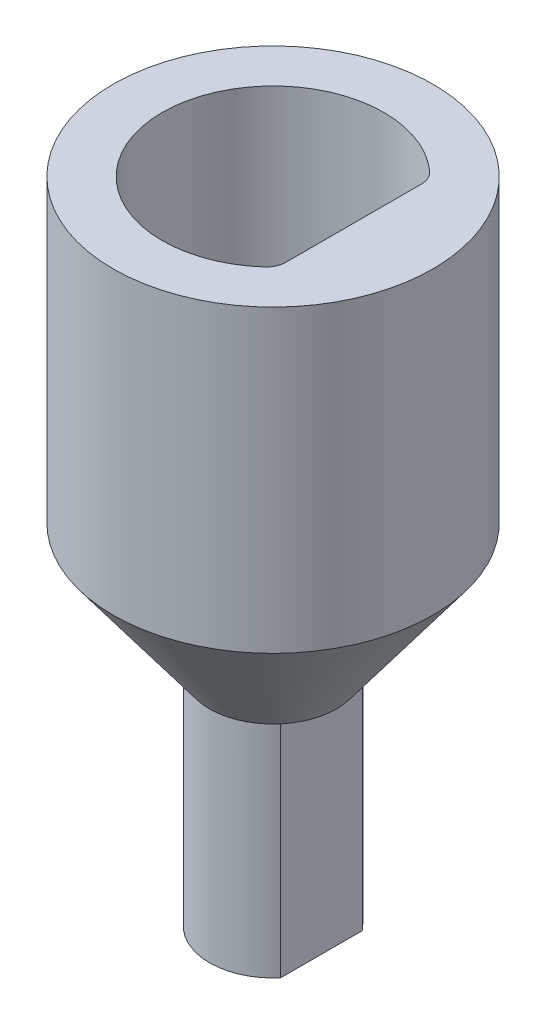
ISO-10303-21;
HEADER;
FILE_DESCRIPTION(('STEP AP214'),'2;1');
FILE_NAME('part.step','',(''),(''),'','','');
FILE_SCHEMA(('AUTOMOTIVE_DESIGN { 1 0 10303 214 1 1 1 1 }'));
ENDSEC;
DATA;
#1=APPLICATION_CONTEXT('core data for automotive mechanical design processes');
#2=APPLICATION_PROTOCOL_DEFINITION('international standard','automotive_design',2000,#1);
#3=PRODUCT_CONTEXT('',#1,'mechanical');
#4=PRODUCT('Part','Part','',(#3));
#5=PRODUCT_RELATED_PRODUCT_CATEGORY('part','',(#4));
#6=PRODUCT_DEFINITION_FORMATION('','',#4);
#7=PRODUCT_DEFINITION_CONTEXT('part definition',#1,'design');
#8=PRODUCT_DEFINITION('design','',#6,#7);
#9=PRODUCT_DEFINITION_SHAPE('','',#8);
#10=(LENGTH_UNIT() NAMED_UNIT(*) SI_UNIT(.MILLI.,.METRE.));
#11=(NAMED_UNIT(*) PLANE_ANGLE_UNIT() SI_UNIT($,.RADIAN.));
#12=(NAMED_UNIT(*) SI_UNIT($,.STERADIAN.) SOLID_ANGLE_UNIT());
#13=UNCERTAINTY_MEASURE_WITH_UNIT(LENGTH_MEASURE(1.E-05),#10,'distance_accuracy_value','');
#14=(GEOMETRIC_REPRESENTATION_CONTEXT(3) GLOBAL_UNCERTAINTY_ASSIGNED_CONTEXT((#13)) GLOBAL_UNIT_ASSIGNED_CONTEXT((#10,
#11,#12)) REPRESENTATION_CONTEXT('',''));
#15=CARTESIAN_POINT('',(0.,0.,0.));
#16=DIRECTION('',(0.,0.,1.));
#17=DIRECTION('',(1.,0.,0.));
#18=AXIS2_PLACEMENT_3D('',#15,#16,#17);
#19=CARTESIAN_POINT('',(0.,-22.4736663820587,0.));
#20=DIRECTION('',(0.,1.,0.));
#21=DIRECTION('',(0.,0.,1.));
#22=AXIS2_PLACEMENT_3D('',#19,#20,#21);
#23=CYLINDRICAL_SURFACE('',#22,3.175);
#24=DIRECTION('',(0.,1.,0.));
#25=VECTOR('',#24,1.);
#26=CARTESIAN_POINT('',(2.425,-22.4736663820587,-2.04939015319192));
#27=LINE('',#26,#25);
#28=CARTESIAN_POINT('',(2.425,-22.4736663820587,-2.04939015319192));
#29=VERTEX_POINT('',#28);
#30=CARTESIAN_POINT('',(2.425,-11.4736663820587,-2.04939015319192));
#31=VERTEX_POINT('',#30);
#32=EDGE_CURVE('E102',#29,#31,#27,.T.);
#33=ORIENTED_EDGE('',*,*,#32,.F.);
#34=CARTESIAN_POINT('',(0.,-22.4736663820587,0.));
#35=DIRECTION('',(0.,1.,0.));
#36=DIRECTION('',(0.,0.,1.));
#37=AXIS2_PLACEMENT_3D('',#34,#35,#36);
#38=CIRCLE('',#37,3.175);
#39=CARTESIAN_POINT('',(2.425,-22.4736663820587,2.04939015319192));
#40=VERTEX_POINT('',#39);
#41=EDGE_CURVE('E107',#29,#40,#38,.T.);
#42=ORIENTED_EDGE('',*,*,#41,.T.);
#43=DIRECTION('',(0.,1.,0.));
#44=VECTOR('',#43,1.);
#45=CARTESIAN_POINT('',(2.425,-22.4736663820587,2.04939015319192));
#46=LINE('',#45,#44);
#47=CARTESIAN_POINT('',(2.425,-11.4736663820587,2.04939015319192));
#48=VERTEX_POINT('',#47);
#49=EDGE_CURVE('E99',#48,#40,#46,.F.);
#50=ORIENTED_EDGE('',*,*,#49,.F.);
#51=CARTESIAN_POINT('',(0.,-11.4736663820587,0.));
#52=DIRECTION('',(0.,1.,0.));
#53=DIRECTION('',(0.,0.,1.));
#54=AXIS2_PLACEMENT_3D('',#51,#52,#53);
#55=CIRCLE('',#54,3.175);
#56=EDGE_CURVE('E94',#31,#48,#55,.T.);
#57=ORIENTED_EDGE('',*,*,#56,.F.);
#58=EDGE_LOOP('',(#33,#42,#50,#57));
#59=FACE_BOUND('',#58,.T.);
#60=ADVANCED_FACE('F35',(#59),#23,.T.);
#61=CARTESIAN_POINT('',(3.175,-22.4736663820587,0.));
#62=DIRECTION('',(0.,1.,0.));
#63=DIRECTION('',(0.,0.,1.));
#64=AXIS2_PLACEMENT_3D('',#61,#62,#63);
#65=PLANE('',#64);
#66=DIRECTION('',(0.,0.,-1.));
#67=VECTOR('',#66,1.);
#68=CARTESIAN_POINT('',(2.425,-22.4736663820587,0.));
#69=LINE('',#68,#67);
#70=EDGE_CURVE('E127',#40,#29,#69,.T.);
#71=ORIENTED_EDGE('',*,*,#70,.F.);
#72=ORIENTED_EDGE('',*,*,#41,.F.);
#73=EDGE_LOOP('',(#71,#72));
#74=FACE_BOUND('',#73,.T.);
#75=ADVANCED_FACE('F164',(#74),#65,.F.);
#76=CARTESIAN_POINT('',(0.,10.,0.));
#77=DIRECTION('',(0.,1.,0.));
#78=DIRECTION('',(0.,0.,1.));
#79=AXIS2_PLACEMENT_3D('',#76,#77,#78);
#80=PLANE('',#79);
#81=CARTESIAN_POINT('',(0.,10.,0.));
#82=DIRECTION('',(0.,1.,0.));
#83=DIRECTION('',(0.,0.,1.));
#84=AXIS2_PLACEMENT_3D('',#81,#82,#83);
#85=CIRCLE('',#84,8.);
#86=CARTESIAN_POINT('',(0.,10.,8.));
#87=VERTEX_POINT('',#86);
#88=EDGE_CURVE('E122',#87,#87,#85,.T.);
#89=ORIENTED_EDGE('',*,*,#88,.T.);
#90=EDGE_LOOP('',(#89));
#91=FACE_BOUND('',#90,.T.);
#92=CARTESIAN_POINT('',(0.,10.,0.));
#93=DIRECTION('',(0.,1.,0.));
#94=DIRECTION('',(0.,0.,1.));
#95=AXIS2_PLACEMENT_3D('',#92,#93,#94);
#96=CIRCLE('',#95,5.55);
#97=CARTESIAN_POINT('',(3.7036963036963,10.,-4.13341670896927));
#98=VERTEX_POINT('',#97);
#99=CARTESIAN_POINT('',(3.7036963036963,10.,4.13341670896927));
#100=VERTEX_POINT('',#99);
#101=EDGE_CURVE('E118',#98,#100,#96,.T.);
#102=ORIENTED_EDGE('',*,*,#101,.F.);
#103=CARTESIAN_POINT('',(3.03636363636364,10.,-3.38865694158742));
#104=DIRECTION('',(0.,1.,0.));
#105=DIRECTION('',(0.,0.,1.));
#106=AXIS2_PLACEMENT_3D('',#103,#104,#105);
#107=CIRCLE('',#106,1.);
#108=CARTESIAN_POINT('',(4.03636363636364,10.,-3.38865694158742));
#109=VERTEX_POINT('',#108);
#110=EDGE_CURVE('E136',#98,#109,#107,.F.);
#111=ORIENTED_EDGE('',*,*,#110,.T.);
#112=DIRECTION('',(0.,0.,-1.));
#113=VECTOR('',#112,1.);
#114=CARTESIAN_POINT('',(4.03636363636364,10.,0.000130643735897155));
#115=LINE('',#114,#113);
#116=CARTESIAN_POINT('',(4.03636363636364,10.,3.38865694158742));
#117=VERTEX_POINT('',#116);
#118=EDGE_CURVE('E116',#117,#109,#115,.T.);
#119=ORIENTED_EDGE('',*,*,#118,.F.);
#120=CARTESIAN_POINT('',(3.03636363636364,10.,3.38865694158742));
#121=DIRECTION('',(0.,1.,0.));
#122=DIRECTION('',(0.,0.,1.));
#123=AXIS2_PLACEMENT_3D('',#120,#121,#122);
#124=CIRCLE('',#123,1.);
#125=EDGE_CURVE('E11',#117,#100,#124,.F.);
#126=ORIENTED_EDGE('',*,*,#125,.T.);
#127=EDGE_LOOP('',(#102,#111,#119,#126));
#128=FACE_BOUND('',#127,.T.);
#129=ADVANCED_FACE('F158',(#91,#128),#80,.T.);
#130=CARTESIAN_POINT('',(0.,10.,0.));
#131=DIRECTION('',(0.,-1.,0.));
#132=DIRECTION('',(0.,0.,-1.));
#133=AXIS2_PLACEMENT_3D('',#130,#131,#132);
#134=CYLINDRICAL_SURFACE('',#133,8.);
#135=ORIENTED_EDGE('',*,*,#88,.F.);
#136=EDGE_LOOP('',(#135));
#137=FACE_BOUND('',#136,.T.);
#138=CARTESIAN_POINT('',(0.,-5.,0.));
#139=DIRECTION('',(0.,1.,0.));
#140=DIRECTION('',(0.,0.,1.));
#141=AXIS2_PLACEMENT_3D('',#138,#139,#140);
#142=CIRCLE('',#141,8.);
#143=CARTESIAN_POINT('',(0.,-5.,8.));
#144=VERTEX_POINT('',#143);
#145=EDGE_CURVE('E93',#144,#144,#142,.T.);
#146=ORIENTED_EDGE('',*,*,#145,.T.);
#147=EDGE_LOOP('',(#146));
#148=FACE_BOUND('',#147,.T.);
#149=ADVANCED_FACE('F182',(#137,#148),#134,.T.);
#150=CARTESIAN_POINT('',(4.03636363636364,10.,0.000130643735897155));
#151=DIRECTION('',(-1.,0.,0.));
#152=DIRECTION('',(0.,0.,1.));
#153=AXIS2_PLACEMENT_3D('',#150,#151,#152);
#154=PLANE('',#153);
#155=DIRECTION('',(0.,0.,-1.));
#156=VECTOR('',#155,1.);
#157=CARTESIAN_POINT('',(4.03636363636364,0.,0.000130643735897155));
#158=LINE('',#157,#156);
#159=CARTESIAN_POINT('',(4.03636363636364,0.,3.38865694158742));
#160=VERTEX_POINT('',#159);
#161=CARTESIAN_POINT('',(4.03636363636364,0.,-3.38865694158742));
#162=VERTEX_POINT('',#161);
#163=EDGE_CURVE('E115',#160,#162,#158,.T.);
#164=ORIENTED_EDGE('',*,*,#163,.F.);
#165=DIRECTION('',(0.,1.,0.));
#166=VECTOR('',#165,1.);
#167=CARTESIAN_POINT('',(4.03636363636364,10.,3.38865694158742));
#168=LINE('',#167,#166);
#169=EDGE_CURVE('E43',#160,#117,#168,.T.);
#170=ORIENTED_EDGE('',*,*,#169,.T.);
#171=ORIENTED_EDGE('',*,*,#118,.T.);
#172=DIRECTION('',(0.,1.,0.));
#173=VECTOR('',#172,1.);
#174=CARTESIAN_POINT('',(4.03636363636364,0.,-3.38865694158742));
#175=LINE('',#174,#173);
#176=EDGE_CURVE('E129',#109,#162,#175,.F.);
#177=ORIENTED_EDGE('',*,*,#176,.T.);
#178=EDGE_LOOP('',(#164,#170,#171,#177));
#179=FACE_BOUND('',#178,.T.);
#180=ADVANCED_FACE('F156',(#179),#154,.T.);
#181=CARTESIAN_POINT('',(0.,10.,0.));
#182=DIRECTION('',(0.,-1.,0.));
#183=DIRECTION('',(0.,0.,-1.));
#184=AXIS2_PLACEMENT_3D('',#181,#182,#183);
#185=CYLINDRICAL_SURFACE('',#184,5.55);
#186=ORIENTED_EDGE('',*,*,#101,.T.);
#187=DIRECTION('',(0.,-1.,0.));
#188=VECTOR('',#187,1.);
#189=CARTESIAN_POINT('',(3.7036963036963,10.,4.13341670896927));
#190=LINE('',#189,#188);
#191=CARTESIAN_POINT('',(3.7036963036963,0.,4.13341670896927));
#192=VERTEX_POINT('',#191);
#193=EDGE_CURVE('E139',#100,#192,#190,.T.);
#194=ORIENTED_EDGE('',*,*,#193,.T.);
#195=CARTESIAN_POINT('',(0.,0.,0.));
#196=DIRECTION('',(0.,1.,0.));
#197=DIRECTION('',(0.,0.,1.));
#198=AXIS2_PLACEMENT_3D('',#195,#196,#197);
#199=CIRCLE('',#198,5.55);
#200=CARTESIAN_POINT('',(3.7036963036963,0.,-4.13341670896927));
#201=VERTEX_POINT('',#200);
#202=EDGE_CURVE('E119',#201,#192,#199,.T.);
#203=ORIENTED_EDGE('',*,*,#202,.F.);
#204=DIRECTION('',(0.,-1.,0.));
#205=VECTOR('',#204,1.);
#206=CARTESIAN_POINT('',(3.70369630369631,10.,-4.13341670896927));
#207=LINE('',#206,#205);
#208=EDGE_CURVE('E134',#201,#98,#207,.F.);
#209=ORIENTED_EDGE('',*,*,#208,.T.);
#210=EDGE_LOOP('',(#186,#194,#203,#209));
#211=FACE_BOUND('',#210,.T.);
#212=ADVANCED_FACE('F145',(#211),#185,.F.);
#213=CARTESIAN_POINT('',(8.,0.,0.));
#214=DIRECTION('',(0.,-1.,0.));
#215=DIRECTION('',(0.,0.,-1.));
#216=AXIS2_PLACEMENT_3D('',#213,#214,#215);
#217=PLANE('',#216);
#218=ORIENTED_EDGE('',*,*,#202,.T.);
#219=CARTESIAN_POINT('',(3.03636363636364,0.,3.38865694158742));
#220=DIRECTION('',(0.,-1.,0.));
#221=DIRECTION('',(0.,0.,-1.));
#222=AXIS2_PLACEMENT_3D('',#219,#220,#221);
#223=CIRCLE('',#222,1.);
#224=EDGE_CURVE('E57',#192,#160,#223,.F.);
#225=ORIENTED_EDGE('',*,*,#224,.T.);
#226=ORIENTED_EDGE('',*,*,#163,.T.);
#227=CARTESIAN_POINT('',(3.03636363636364,0.,-3.38865694158742));
#228=DIRECTION('',(0.,-1.,0.));
#229=DIRECTION('',(0.,0.,-1.));
#230=AXIS2_PLACEMENT_3D('',#227,#228,#229);
#231=CIRCLE('',#230,1.);
#232=EDGE_CURVE('E132',#162,#201,#231,.F.);
#233=ORIENTED_EDGE('',*,*,#232,.T.);
#234=EDGE_LOOP('',(#218,#225,#226,#233));
#235=FACE_BOUND('',#234,.T.);
#236=ADVANCED_FACE('F150',(#235),#217,.F.);
#237=CARTESIAN_POINT('',(0.,-11.4736663820587,0.));
#238=DIRECTION('',(0.,1.,0.));
#239=DIRECTION('',(0.,0.,1.));
#240=AXIS2_PLACEMENT_3D('',#237,#238,#239);
#241=CONICAL_SURFACE('',#240,3.175,0.640503838881441);
#242=ORIENTED_EDGE('',*,*,#145,.F.);
#243=EDGE_LOOP('',(#242));
#244=FACE_BOUND('',#243,.T.);
#245=EDGE_CURVE('E85',#48,#31,#55,.T.);
#246=ORIENTED_EDGE('',*,*,#245,.T.);
#247=ORIENTED_EDGE('',*,*,#56,.T.);
#248=EDGE_LOOP('',(#246,#247));
#249=FACE_BOUND('',#248,.T.);
#250=ADVANCED_FACE('F109',(#244,#249),#241,.T.);
#251=CARTESIAN_POINT('',(2.425,-11.4736663820587,12.));
#252=DIRECTION('',(0.,-1.,0.));
#253=DIRECTION('',(0.,0.,-1.));
#254=AXIS2_PLACEMENT_3D('',#251,#252,#253);
#255=PLANE('',#254);
#256=DIRECTION('',(0.,0.,-1.));
#257=VECTOR('',#256,1.);
#258=CARTESIAN_POINT('',(2.425,-11.4736663820587,12.));
#259=LINE('',#258,#257);
#260=EDGE_CURVE('E88',#48,#31,#259,.T.);
#261=ORIENTED_EDGE('',*,*,#260,.T.);
#262=ORIENTED_EDGE('',*,*,#245,.F.);
#263=EDGE_LOOP('',(#261,#262));
#264=FACE_BOUND('',#263,.T.);
#265=ADVANCED_FACE('F87',(#264),#255,.T.);
#266=CARTESIAN_POINT('',(2.425,-22.4736663820587,12.));
#267=DIRECTION('',(1.,0.,0.));
#268=DIRECTION('',(0.,0.,-1.));
#269=AXIS2_PLACEMENT_3D('',#266,#267,#268);
#270=PLANE('',#269);
#271=ORIENTED_EDGE('',*,*,#32,.T.);
#272=ORIENTED_EDGE('',*,*,#260,.F.);
#273=ORIENTED_EDGE('',*,*,#49,.T.);
#274=ORIENTED_EDGE('',*,*,#70,.T.);
#275=EDGE_LOOP('',(#271,#272,#273,#274));
#276=FACE_BOUND('',#275,.T.);
#277=ADVANCED_FACE('F98',(#276),#270,.T.);
#278=CARTESIAN_POINT('',(3.03636363636364,10.,-3.38865694158742));
#279=DIRECTION('',(0.,-1.,0.));
#280=DIRECTION('',(0.,0.,-1.));
#281=AXIS2_PLACEMENT_3D('',#278,#279,#280);
#282=CYLINDRICAL_SURFACE('',#281,1.);
#283=ORIENTED_EDGE('',*,*,#110,.F.);
#284=ORIENTED_EDGE('',*,*,#208,.F.);
#285=ORIENTED_EDGE('',*,*,#232,.F.);
#286=ORIENTED_EDGE('',*,*,#176,.F.);
#287=EDGE_LOOP('',(#283,#284,#285,#286));
#288=FACE_BOUND('',#287,.T.);
#289=ADVANCED_FACE('F155',(#288),#282,.F.);
#290=CARTESIAN_POINT('',(3.03636363636364,10.,3.38865694158742));
#291=DIRECTION('',(0.,-1.,0.));
#292=DIRECTION('',(0.,0.,-1.));
#293=AXIS2_PLACEMENT_3D('',#290,#291,#292);
#294=CYLINDRICAL_SURFACE('',#293,1.);
#295=ORIENTED_EDGE('',*,*,#125,.F.);
#296=ORIENTED_EDGE('',*,*,#169,.F.);
#297=ORIENTED_EDGE('',*,*,#224,.F.);
#298=ORIENTED_EDGE('',*,*,#193,.F.);
#299=EDGE_LOOP('',(#295,#296,#297,#298));
#300=FACE_BOUND('',#299,.T.);
#301=ADVANCED_FACE('F37',(#300),#294,.F.);
#302=CLOSED_SHELL('',(#60,#75,#129,#149,#180,#212,#236,#250,#265,#277,#289,#301));
#303=MANIFOLD_SOLID_BREP('B2',#302);
#304=ADVANCED_BREP_SHAPE_REPRESENTATION('',(#18,#303),#14);
#305=SHAPE_DEFINITION_REPRESENTATION(#9,#304);
ENDSEC;
END-ISO-10303-21;
